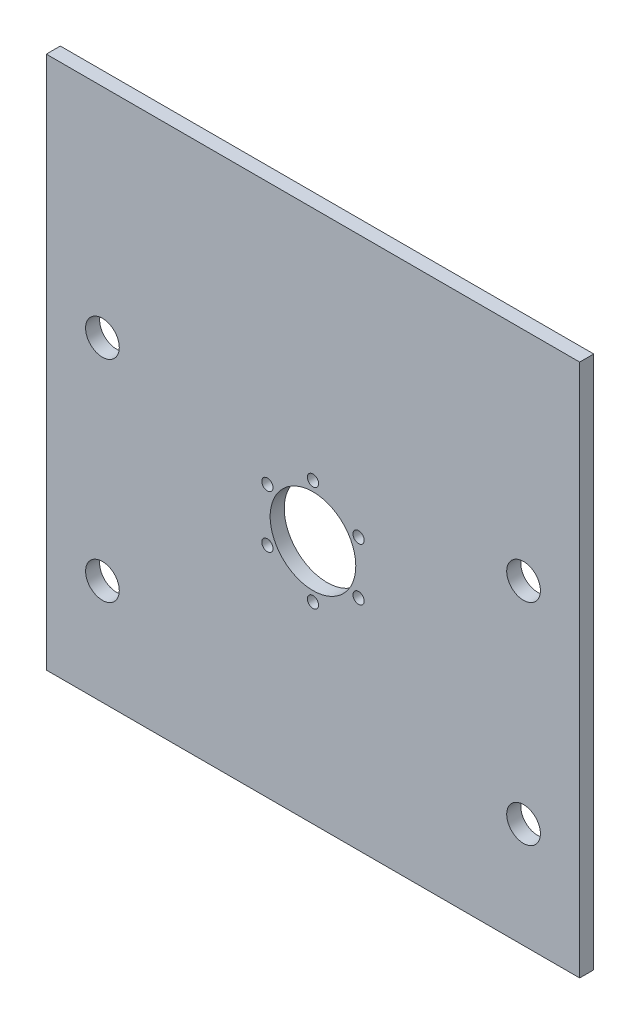
ISO-10303-21;
HEADER;
FILE_DESCRIPTION(('STEP AP214'),'2;1');
FILE_NAME('part.step','',(''),(''),'','','');
FILE_SCHEMA(('AUTOMOTIVE_DESIGN { 1 0 10303 214 1 1 1 1 }'));
ENDSEC;
DATA;
#1=APPLICATION_CONTEXT('core data for automotive mechanical design processes');
#2=APPLICATION_PROTOCOL_DEFINITION('international standard','automotive_design',2000,#1);
#3=PRODUCT_CONTEXT('',#1,'mechanical');
#4=PRODUCT('Part','Part','',(#3));
#5=PRODUCT_RELATED_PRODUCT_CATEGORY('part','',(#4));
#6=PRODUCT_DEFINITION_FORMATION('','',#4);
#7=PRODUCT_DEFINITION_CONTEXT('part definition',#1,'design');
#8=PRODUCT_DEFINITION('design','',#6,#7);
#9=PRODUCT_DEFINITION_SHAPE('','',#8);
#10=(LENGTH_UNIT() NAMED_UNIT(*) SI_UNIT(.MILLI.,.METRE.));
#11=(NAMED_UNIT(*) PLANE_ANGLE_UNIT() SI_UNIT($,.RADIAN.));
#12=(NAMED_UNIT(*) SI_UNIT($,.STERADIAN.) SOLID_ANGLE_UNIT());
#13=UNCERTAINTY_MEASURE_WITH_UNIT(LENGTH_MEASURE(1.E-05),#10,'distance_accuracy_value','');
#14=(GEOMETRIC_REPRESENTATION_CONTEXT(3) GLOBAL_UNCERTAINTY_ASSIGNED_CONTEXT((#13)) GLOBAL_UNIT_ASSIGNED_CONTEXT((#10,
#11,#12)) REPRESENTATION_CONTEXT('',''));
#15=CARTESIAN_POINT('',(0.,0.,0.));
#16=DIRECTION('',(0.,0.,1.));
#17=DIRECTION('',(1.,0.,0.));
#18=AXIS2_PLACEMENT_3D('',#15,#16,#17);
#19=CARTESIAN_POINT('',(0.,0.,5.));
#20=DIRECTION('',(0.,0.,-1.));
#21=DIRECTION('',(-1.,0.,0.));
#22=AXIS2_PLACEMENT_3D('',#19,#20,#21);
#23=PLANE('',#22);
#24=DIRECTION('',(0.,-1.,0.));
#25=VECTOR('',#24,1.);
#26=CARTESIAN_POINT('',(0.,0.,5.));
#27=LINE('',#26,#25);
#28=CARTESIAN_POINT('',(0.,190.,5.));
#29=VERTEX_POINT('',#28);
#30=CARTESIAN_POINT('',(0.,0.,5.));
#31=VERTEX_POINT('',#30);
#32=EDGE_CURVE('E69',#29,#31,#27,.T.);
#33=ORIENTED_EDGE('',*,*,#32,.T.);
#34=DIRECTION('',(1.,0.,0.));
#35=VECTOR('',#34,1.);
#36=CARTESIAN_POINT('',(0.,0.,5.));
#37=LINE('',#36,#35);
#38=CARTESIAN_POINT('',(190.,0.,5.));
#39=VERTEX_POINT('',#38);
#40=EDGE_CURVE('E64',#31,#39,#37,.T.);
#41=ORIENTED_EDGE('',*,*,#40,.T.);
#42=DIRECTION('',(0.,1.,0.));
#43=VECTOR('',#42,1.);
#44=CARTESIAN_POINT('',(190.,0.,5.));
#45=LINE('',#44,#43);
#46=CARTESIAN_POINT('',(190.,190.,5.));
#47=VERTEX_POINT('',#46);
#48=EDGE_CURVE('E67',#39,#47,#45,.T.);
#49=ORIENTED_EDGE('',*,*,#48,.T.);
#50=DIRECTION('',(-1.,0.,0.));
#51=VECTOR('',#50,1.);
#52=CARTESIAN_POINT('',(0.,190.,5.));
#53=LINE('',#52,#51);
#54=EDGE_CURVE('E34',#47,#29,#53,.T.);
#55=ORIENTED_EDGE('',*,*,#54,.T.);
#56=EDGE_LOOP('',(#33,#41,#49,#55));
#57=FACE_BOUND('',#56,.T.);
#58=CARTESIAN_POINT('',(20.,112.5,5.));
#59=DIRECTION('',(0.,0.,1.));
#60=DIRECTION('',(1.,0.,0.));
#61=AXIS2_PLACEMENT_3D('',#58,#59,#60);
#62=CIRCLE('',#61,6.);
#63=CARTESIAN_POINT('',(26.,112.5,5.));
#64=VERTEX_POINT('',#63);
#65=EDGE_CURVE('E84',#64,#64,#62,.T.);
#66=ORIENTED_EDGE('',*,*,#65,.F.);
#67=EDGE_LOOP('',(#66));
#68=FACE_BOUND('',#67,.T.);
#69=CARTESIAN_POINT('',(20.,37.5,5.));
#70=DIRECTION('',(0.,0.,1.));
#71=DIRECTION('',(1.,0.,0.));
#72=AXIS2_PLACEMENT_3D('',#69,#70,#71);
#73=CIRCLE('',#72,6.);
#74=CARTESIAN_POINT('',(26.,37.5,5.));
#75=VERTEX_POINT('',#74);
#76=EDGE_CURVE('E99',#75,#75,#73,.T.);
#77=ORIENTED_EDGE('',*,*,#76,.F.);
#78=EDGE_LOOP('',(#77));
#79=FACE_BOUND('',#78,.T.);
#80=CARTESIAN_POINT('',(170.,112.5,5.));
#81=DIRECTION('',(0.,0.,1.));
#82=DIRECTION('',(1.,0.,0.));
#83=AXIS2_PLACEMENT_3D('',#80,#81,#82);
#84=CIRCLE('',#83,6.);
#85=CARTESIAN_POINT('',(176.,112.5,5.));
#86=VERTEX_POINT('',#85);
#87=EDGE_CURVE('E105',#86,#86,#84,.T.);
#88=ORIENTED_EDGE('',*,*,#87,.F.);
#89=EDGE_LOOP('',(#88));
#90=FACE_BOUND('',#89,.T.);
#91=CARTESIAN_POINT('',(170.,37.5,5.));
#92=DIRECTION('',(0.,0.,1.));
#93=DIRECTION('',(1.,0.,0.));
#94=AXIS2_PLACEMENT_3D('',#91,#92,#93);
#95=CIRCLE('',#94,6.);
#96=CARTESIAN_POINT('',(176.,37.5,5.));
#97=VERTEX_POINT('',#96);
#98=EDGE_CURVE('E111',#97,#97,#95,.T.);
#99=ORIENTED_EDGE('',*,*,#98,.F.);
#100=EDGE_LOOP('',(#99));
#101=FACE_BOUND('',#100,.T.);
#102=CARTESIAN_POINT('',(95.,87.2453695931957,5.));
#103=DIRECTION('',(0.,0.,1.));
#104=DIRECTION('',(1.,0.,0.));
#105=AXIS2_PLACEMENT_3D('',#102,#103,#104);
#106=CIRCLE('',#105,15.25);
#107=CARTESIAN_POINT('',(110.25,87.2453695931957,5.));
#108=VERTEX_POINT('',#107);
#109=EDGE_CURVE('E117',#108,#108,#106,.T.);
#110=ORIENTED_EDGE('',*,*,#109,.F.);
#111=EDGE_LOOP('',(#110));
#112=FACE_BOUND('',#111,.T.);
#113=CARTESIAN_POINT('',(95.,105.995369593196,5.));
#114=DIRECTION('',(0.,0.,1.));
#115=DIRECTION('',(1.,0.,0.));
#116=AXIS2_PLACEMENT_3D('',#113,#114,#115);
#117=CIRCLE('',#116,2.);
#118=CARTESIAN_POINT('',(97.,105.995369593196,5.));
#119=VERTEX_POINT('',#118);
#120=EDGE_CURVE('E123',#119,#119,#117,.T.);
#121=ORIENTED_EDGE('',*,*,#120,.F.);
#122=EDGE_LOOP('',(#121));
#123=FACE_BOUND('',#122,.T.);
#124=CARTESIAN_POINT('',(111.237976320959,96.6203695931961,5.));
#125=DIRECTION('',(0.,0.,1.));
#126=DIRECTION('',(1.,0.,0.));
#127=AXIS2_PLACEMENT_3D('',#124,#125,#126);
#128=CIRCLE('',#127,1.99999999999997);
#129=CARTESIAN_POINT('',(113.237976320959,96.6203695931961,5.));
#130=VERTEX_POINT('',#129);
#131=EDGE_CURVE('E129',#130,#130,#128,.T.);
#132=ORIENTED_EDGE('',*,*,#131,.F.);
#133=EDGE_LOOP('',(#132));
#134=FACE_BOUND('',#133,.T.);
#135=CARTESIAN_POINT('',(111.237976320959,77.870369593196,5.));
#136=DIRECTION('',(0.,0.,1.));
#137=DIRECTION('',(1.,0.,0.));
#138=AXIS2_PLACEMENT_3D('',#135,#136,#137);
#139=CIRCLE('',#138,2.);
#140=CARTESIAN_POINT('',(113.237976320959,77.870369593196,5.));
#141=VERTEX_POINT('',#140);
#142=EDGE_CURVE('E135',#141,#141,#139,.T.);
#143=ORIENTED_EDGE('',*,*,#142,.F.);
#144=EDGE_LOOP('',(#143));
#145=FACE_BOUND('',#144,.T.);
#146=CARTESIAN_POINT('',(95.,68.4953695931957,5.));
#147=DIRECTION('',(0.,0.,1.));
#148=DIRECTION('',(1.,0.,0.));
#149=AXIS2_PLACEMENT_3D('',#146,#147,#148);
#150=CIRCLE('',#149,2.);
#151=CARTESIAN_POINT('',(97.,68.4953695931957,5.));
#152=VERTEX_POINT('',#151);
#153=EDGE_CURVE('E141',#152,#152,#150,.T.);
#154=ORIENTED_EDGE('',*,*,#153,.F.);
#155=EDGE_LOOP('',(#154));
#156=FACE_BOUND('',#155,.T.);
#157=CARTESIAN_POINT('',(78.7620236790425,77.8703695931954,5.));
#158=DIRECTION('',(0.,0.,1.));
#159=DIRECTION('',(1.,0.,0.));
#160=AXIS2_PLACEMENT_3D('',#157,#158,#159);
#161=CIRCLE('',#160,2.);
#162=CARTESIAN_POINT('',(80.7620236790425,77.8703695931954,5.));
#163=VERTEX_POINT('',#162);
#164=EDGE_CURVE('E147',#163,#163,#161,.T.);
#165=ORIENTED_EDGE('',*,*,#164,.F.);
#166=EDGE_LOOP('',(#165));
#167=FACE_BOUND('',#166,.T.);
#168=CARTESIAN_POINT('',(78.7620236790422,96.6203695931954,5.));
#169=DIRECTION('',(0.,0.,1.));
#170=DIRECTION('',(1.,0.,0.));
#171=AXIS2_PLACEMENT_3D('',#168,#169,#170);
#172=CIRCLE('',#171,2.);
#173=CARTESIAN_POINT('',(80.7620236790422,96.6203695931954,5.));
#174=VERTEX_POINT('',#173);
#175=EDGE_CURVE('E153',#174,#174,#172,.T.);
#176=ORIENTED_EDGE('',*,*,#175,.F.);
#177=EDGE_LOOP('',(#176));
#178=FACE_BOUND('',#177,.T.);
#179=ADVANCED_FACE('F17',(#57,#68,#79,#90,#101,#112,#123,#134,#145,#156,#167,#178),#23,.F.);
#180=CARTESIAN_POINT('',(0.,0.,0.));
#181=DIRECTION('',(0.,0.,-1.));
#182=DIRECTION('',(-1.,0.,0.));
#183=AXIS2_PLACEMENT_3D('',#180,#181,#182);
#184=PLANE('',#183);
#185=CARTESIAN_POINT('',(78.7620236790425,77.8703695931954,0.));
#186=DIRECTION('',(0.,0.,1.));
#187=DIRECTION('',(1.,0.,0.));
#188=AXIS2_PLACEMENT_3D('',#185,#186,#187);
#189=CIRCLE('',#188,2.);
#190=CARTESIAN_POINT('',(80.7620236790425,77.8703695931954,0.));
#191=VERTEX_POINT('',#190);
#192=EDGE_CURVE('E150',#191,#191,#189,.T.);
#193=ORIENTED_EDGE('',*,*,#192,.T.);
#194=EDGE_LOOP('',(#193));
#195=FACE_BOUND('',#194,.T.);
#196=CARTESIAN_POINT('',(111.237976320959,77.870369593196,0.));
#197=DIRECTION('',(0.,0.,1.));
#198=DIRECTION('',(1.,0.,0.));
#199=AXIS2_PLACEMENT_3D('',#196,#197,#198);
#200=CIRCLE('',#199,2.);
#201=CARTESIAN_POINT('',(113.237976320959,77.870369593196,0.));
#202=VERTEX_POINT('',#201);
#203=EDGE_CURVE('E138',#202,#202,#200,.T.);
#204=ORIENTED_EDGE('',*,*,#203,.T.);
#205=EDGE_LOOP('',(#204));
#206=FACE_BOUND('',#205,.T.);
#207=CARTESIAN_POINT('',(95.,105.995369593196,0.));
#208=DIRECTION('',(0.,0.,1.));
#209=DIRECTION('',(1.,0.,0.));
#210=AXIS2_PLACEMENT_3D('',#207,#208,#209);
#211=CIRCLE('',#210,2.);
#212=CARTESIAN_POINT('',(97.,105.995369593196,0.));
#213=VERTEX_POINT('',#212);
#214=EDGE_CURVE('E126',#213,#213,#211,.T.);
#215=ORIENTED_EDGE('',*,*,#214,.T.);
#216=EDGE_LOOP('',(#215));
#217=FACE_BOUND('',#216,.T.);
#218=CARTESIAN_POINT('',(170.,37.5,0.));
#219=DIRECTION('',(0.,0.,1.));
#220=DIRECTION('',(1.,0.,0.));
#221=AXIS2_PLACEMENT_3D('',#218,#219,#220);
#222=CIRCLE('',#221,6.);
#223=CARTESIAN_POINT('',(176.,37.5,0.));
#224=VERTEX_POINT('',#223);
#225=EDGE_CURVE('E114',#224,#224,#222,.T.);
#226=ORIENTED_EDGE('',*,*,#225,.T.);
#227=EDGE_LOOP('',(#226));
#228=FACE_BOUND('',#227,.T.);
#229=CARTESIAN_POINT('',(20.,37.5,0.));
#230=DIRECTION('',(0.,0.,1.));
#231=DIRECTION('',(1.,0.,0.));
#232=AXIS2_PLACEMENT_3D('',#229,#230,#231);
#233=CIRCLE('',#232,6.);
#234=CARTESIAN_POINT('',(26.,37.5,0.));
#235=VERTEX_POINT('',#234);
#236=EDGE_CURVE('E102',#235,#235,#233,.T.);
#237=ORIENTED_EDGE('',*,*,#236,.T.);
#238=EDGE_LOOP('',(#237));
#239=FACE_BOUND('',#238,.T.);
#240=DIRECTION('',(0.,-1.,0.));
#241=VECTOR('',#240,1.);
#242=CARTESIAN_POINT('',(0.,0.,0.));
#243=LINE('',#242,#241);
#244=CARTESIAN_POINT('',(0.,190.,0.));
#245=VERTEX_POINT('',#244);
#246=CARTESIAN_POINT('',(0.,0.,0.));
#247=VERTEX_POINT('',#246);
#248=EDGE_CURVE('E81',#245,#247,#243,.T.);
#249=ORIENTED_EDGE('',*,*,#248,.F.);
#250=DIRECTION('',(-1.,0.,0.));
#251=VECTOR('',#250,1.);
#252=CARTESIAN_POINT('',(0.,190.,0.));
#253=LINE('',#252,#251);
#254=CARTESIAN_POINT('',(190.,190.,0.));
#255=VERTEX_POINT('',#254);
#256=EDGE_CURVE('E57',#255,#245,#253,.T.);
#257=ORIENTED_EDGE('',*,*,#256,.F.);
#258=DIRECTION('',(0.,1.,0.));
#259=VECTOR('',#258,1.);
#260=CARTESIAN_POINT('',(190.,0.,0.));
#261=LINE('',#260,#259);
#262=CARTESIAN_POINT('',(190.,0.,0.));
#263=VERTEX_POINT('',#262);
#264=EDGE_CURVE('E51',#263,#255,#261,.T.);
#265=ORIENTED_EDGE('',*,*,#264,.F.);
#266=DIRECTION('',(1.,0.,0.));
#267=VECTOR('',#266,1.);
#268=CARTESIAN_POINT('',(0.,0.,0.));
#269=LINE('',#268,#267);
#270=EDGE_CURVE('E73',#247,#263,#269,.T.);
#271=ORIENTED_EDGE('',*,*,#270,.F.);
#272=EDGE_LOOP('',(#249,#257,#265,#271));
#273=FACE_BOUND('',#272,.T.);
#274=CARTESIAN_POINT('',(20.,112.5,0.));
#275=DIRECTION('',(0.,0.,1.));
#276=DIRECTION('',(1.,0.,0.));
#277=AXIS2_PLACEMENT_3D('',#274,#275,#276);
#278=CIRCLE('',#277,6.);
#279=CARTESIAN_POINT('',(26.,112.5,0.));
#280=VERTEX_POINT('',#279);
#281=EDGE_CURVE('E96',#280,#280,#278,.T.);
#282=ORIENTED_EDGE('',*,*,#281,.T.);
#283=EDGE_LOOP('',(#282));
#284=FACE_BOUND('',#283,.T.);
#285=CARTESIAN_POINT('',(170.,112.5,0.));
#286=DIRECTION('',(0.,0.,1.));
#287=DIRECTION('',(1.,0.,0.));
#288=AXIS2_PLACEMENT_3D('',#285,#286,#287);
#289=CIRCLE('',#288,6.);
#290=CARTESIAN_POINT('',(176.,112.5,0.));
#291=VERTEX_POINT('',#290);
#292=EDGE_CURVE('E108',#291,#291,#289,.T.);
#293=ORIENTED_EDGE('',*,*,#292,.T.);
#294=EDGE_LOOP('',(#293));
#295=FACE_BOUND('',#294,.T.);
#296=CARTESIAN_POINT('',(95.,87.2453695931957,0.));
#297=DIRECTION('',(0.,0.,1.));
#298=DIRECTION('',(1.,0.,0.));
#299=AXIS2_PLACEMENT_3D('',#296,#297,#298);
#300=CIRCLE('',#299,15.25);
#301=CARTESIAN_POINT('',(110.25,87.2453695931957,0.));
#302=VERTEX_POINT('',#301);
#303=EDGE_CURVE('E120',#302,#302,#300,.T.);
#304=ORIENTED_EDGE('',*,*,#303,.T.);
#305=EDGE_LOOP('',(#304));
#306=FACE_BOUND('',#305,.T.);
#307=CARTESIAN_POINT('',(111.237976320959,96.6203695931961,0.));
#308=DIRECTION('',(0.,0.,1.));
#309=DIRECTION('',(1.,0.,0.));
#310=AXIS2_PLACEMENT_3D('',#307,#308,#309);
#311=CIRCLE('',#310,1.99999999999997);
#312=CARTESIAN_POINT('',(113.237976320959,96.6203695931961,0.));
#313=VERTEX_POINT('',#312);
#314=EDGE_CURVE('E132',#313,#313,#311,.T.);
#315=ORIENTED_EDGE('',*,*,#314,.T.);
#316=EDGE_LOOP('',(#315));
#317=FACE_BOUND('',#316,.T.);
#318=CARTESIAN_POINT('',(95.,68.4953695931957,0.));
#319=DIRECTION('',(0.,0.,1.));
#320=DIRECTION('',(1.,0.,0.));
#321=AXIS2_PLACEMENT_3D('',#318,#319,#320);
#322=CIRCLE('',#321,2.);
#323=CARTESIAN_POINT('',(97.,68.4953695931957,0.));
#324=VERTEX_POINT('',#323);
#325=EDGE_CURVE('E144',#324,#324,#322,.T.);
#326=ORIENTED_EDGE('',*,*,#325,.T.);
#327=EDGE_LOOP('',(#326));
#328=FACE_BOUND('',#327,.T.);
#329=CARTESIAN_POINT('',(78.7620236790422,96.6203695931954,0.));
#330=DIRECTION('',(0.,0.,1.));
#331=DIRECTION('',(1.,0.,0.));
#332=AXIS2_PLACEMENT_3D('',#329,#330,#331);
#333=CIRCLE('',#332,2.);
#334=CARTESIAN_POINT('',(80.7620236790422,96.6203695931954,0.));
#335=VERTEX_POINT('',#334);
#336=EDGE_CURVE('E156',#335,#335,#333,.T.);
#337=ORIENTED_EDGE('',*,*,#336,.T.);
#338=EDGE_LOOP('',(#337));
#339=FACE_BOUND('',#338,.T.);
#340=ADVANCED_FACE('F92',(#195,#206,#217,#228,#239,#273,#284,#295,#306,#317,#328,#339),#184,.T.);
#341=CARTESIAN_POINT('',(0.,0.,5.));
#342=DIRECTION('',(1.,0.,0.));
#343=DIRECTION('',(0.,0.,-1.));
#344=AXIS2_PLACEMENT_3D('',#341,#342,#343);
#345=PLANE('',#344);
#346=ORIENTED_EDGE('',*,*,#248,.T.);
#347=DIRECTION('',(0.,0.,-1.));
#348=VECTOR('',#347,1.);
#349=CARTESIAN_POINT('',(0.,0.,5.));
#350=LINE('',#349,#348);
#351=EDGE_CURVE('E11',#31,#247,#350,.T.);
#352=ORIENTED_EDGE('',*,*,#351,.F.);
#353=ORIENTED_EDGE('',*,*,#32,.F.);
#354=DIRECTION('',(0.,0.,-1.));
#355=VECTOR('',#354,1.);
#356=CARTESIAN_POINT('',(0.,190.,5.));
#357=LINE('',#356,#355);
#358=EDGE_CURVE('E77',#29,#245,#357,.T.);
#359=ORIENTED_EDGE('',*,*,#358,.T.);
#360=EDGE_LOOP('',(#346,#352,#353,#359));
#361=FACE_BOUND('',#360,.T.);
#362=ADVANCED_FACE('F19',(#361),#345,.F.);
#363=CARTESIAN_POINT('',(0.,0.,5.));
#364=DIRECTION('',(0.,1.,0.));
#365=DIRECTION('',(0.,0.,1.));
#366=AXIS2_PLACEMENT_3D('',#363,#364,#365);
#367=PLANE('',#366);
#368=ORIENTED_EDGE('',*,*,#270,.T.);
#369=DIRECTION('',(0.,0.,-1.));
#370=VECTOR('',#369,1.);
#371=CARTESIAN_POINT('',(190.,0.,5.));
#372=LINE('',#371,#370);
#373=EDGE_CURVE('E26',#39,#263,#372,.T.);
#374=ORIENTED_EDGE('',*,*,#373,.F.);
#375=ORIENTED_EDGE('',*,*,#40,.F.);
#376=ORIENTED_EDGE('',*,*,#351,.T.);
#377=EDGE_LOOP('',(#368,#374,#375,#376));
#378=FACE_BOUND('',#377,.T.);
#379=ADVANCED_FACE('F72',(#378),#367,.F.);
#380=CARTESIAN_POINT('',(190.,0.,5.));
#381=DIRECTION('',(-1.,0.,0.));
#382=DIRECTION('',(0.,0.,1.));
#383=AXIS2_PLACEMENT_3D('',#380,#381,#382);
#384=PLANE('',#383);
#385=ORIENTED_EDGE('',*,*,#264,.T.);
#386=DIRECTION('',(0.,0.,-1.));
#387=VECTOR('',#386,1.);
#388=CARTESIAN_POINT('',(190.,190.,5.));
#389=LINE('',#388,#387);
#390=EDGE_CURVE('E74',#47,#255,#389,.T.);
#391=ORIENTED_EDGE('',*,*,#390,.F.);
#392=ORIENTED_EDGE('',*,*,#48,.F.);
#393=ORIENTED_EDGE('',*,*,#373,.T.);
#394=EDGE_LOOP('',(#385,#391,#392,#393));
#395=FACE_BOUND('',#394,.T.);
#396=ADVANCED_FACE('F75',(#395),#384,.F.);
#397=CARTESIAN_POINT('',(0.,190.,5.));
#398=DIRECTION('',(0.,-1.,0.));
#399=DIRECTION('',(0.,0.,-1.));
#400=AXIS2_PLACEMENT_3D('',#397,#398,#399);
#401=PLANE('',#400);
#402=ORIENTED_EDGE('',*,*,#256,.T.);
#403=ORIENTED_EDGE('',*,*,#358,.F.);
#404=ORIENTED_EDGE('',*,*,#54,.F.);
#405=ORIENTED_EDGE('',*,*,#390,.T.);
#406=EDGE_LOOP('',(#402,#403,#404,#405));
#407=FACE_BOUND('',#406,.T.);
#408=ADVANCED_FACE('F89',(#407),#401,.F.);
#409=CARTESIAN_POINT('',(20.,112.5,5.));
#410=DIRECTION('',(0.,0.,-1.));
#411=DIRECTION('',(-1.,0.,0.));
#412=AXIS2_PLACEMENT_3D('',#409,#410,#411);
#413=CYLINDRICAL_SURFACE('',#412,6.);
#414=ORIENTED_EDGE('',*,*,#65,.T.);
#415=EDGE_LOOP('',(#414));
#416=FACE_BOUND('',#415,.T.);
#417=ORIENTED_EDGE('',*,*,#281,.F.);
#418=EDGE_LOOP('',(#417));
#419=FACE_BOUND('',#418,.T.);
#420=ADVANCED_FACE('F175',(#416,#419),#413,.F.);
#421=CARTESIAN_POINT('',(20.,37.5,5.));
#422=DIRECTION('',(0.,0.,-1.));
#423=DIRECTION('',(-1.,0.,0.));
#424=AXIS2_PLACEMENT_3D('',#421,#422,#423);
#425=CYLINDRICAL_SURFACE('',#424,6.);
#426=ORIENTED_EDGE('',*,*,#76,.T.);
#427=EDGE_LOOP('',(#426));
#428=FACE_BOUND('',#427,.T.);
#429=ORIENTED_EDGE('',*,*,#236,.F.);
#430=EDGE_LOOP('',(#429));
#431=FACE_BOUND('',#430,.T.);
#432=ADVANCED_FACE('F228',(#428,#431),#425,.F.);
#433=CARTESIAN_POINT('',(170.,112.5,5.));
#434=DIRECTION('',(0.,0.,-1.));
#435=DIRECTION('',(-1.,0.,0.));
#436=AXIS2_PLACEMENT_3D('',#433,#434,#435);
#437=CYLINDRICAL_SURFACE('',#436,6.);
#438=ORIENTED_EDGE('',*,*,#87,.T.);
#439=EDGE_LOOP('',(#438));
#440=FACE_BOUND('',#439,.T.);
#441=ORIENTED_EDGE('',*,*,#292,.F.);
#442=EDGE_LOOP('',(#441));
#443=FACE_BOUND('',#442,.T.);
#444=ADVANCED_FACE('F235',(#440,#443),#437,.F.);
#445=CARTESIAN_POINT('',(170.,37.5,5.));
#446=DIRECTION('',(0.,0.,-1.));
#447=DIRECTION('',(-1.,0.,0.));
#448=AXIS2_PLACEMENT_3D('',#445,#446,#447);
#449=CYLINDRICAL_SURFACE('',#448,6.);
#450=ORIENTED_EDGE('',*,*,#98,.T.);
#451=EDGE_LOOP('',(#450));
#452=FACE_BOUND('',#451,.T.);
#453=ORIENTED_EDGE('',*,*,#225,.F.);
#454=EDGE_LOOP('',(#453));
#455=FACE_BOUND('',#454,.T.);
#456=ADVANCED_FACE('F243',(#452,#455),#449,.F.);
#457=CARTESIAN_POINT('',(95.,87.2453695931957,5.));
#458=DIRECTION('',(0.,0.,-1.));
#459=DIRECTION('',(-1.,0.,0.));
#460=AXIS2_PLACEMENT_3D('',#457,#458,#459);
#461=CYLINDRICAL_SURFACE('',#460,15.25);
#462=ORIENTED_EDGE('',*,*,#109,.T.);
#463=EDGE_LOOP('',(#462));
#464=FACE_BOUND('',#463,.T.);
#465=ORIENTED_EDGE('',*,*,#303,.F.);
#466=EDGE_LOOP('',(#465));
#467=FACE_BOUND('',#466,.T.);
#468=ADVANCED_FACE('F252',(#464,#467),#461,.F.);
#469=CARTESIAN_POINT('',(95.,105.995369593196,5.));
#470=DIRECTION('',(0.,0.,-1.));
#471=DIRECTION('',(-1.,0.,0.));
#472=AXIS2_PLACEMENT_3D('',#469,#470,#471);
#473=CYLINDRICAL_SURFACE('',#472,2.);
#474=ORIENTED_EDGE('',*,*,#120,.T.);
#475=EDGE_LOOP('',(#474));
#476=FACE_BOUND('',#475,.T.);
#477=ORIENTED_EDGE('',*,*,#214,.F.);
#478=EDGE_LOOP('',(#477));
#479=FACE_BOUND('',#478,.T.);
#480=ADVANCED_FACE('F261',(#476,#479),#473,.F.);
#481=CARTESIAN_POINT('',(111.237976320959,96.6203695931961,5.));
#482=DIRECTION('',(0.,0.,-1.));
#483=DIRECTION('',(-1.,0.,0.));
#484=AXIS2_PLACEMENT_3D('',#481,#482,#483);
#485=CYLINDRICAL_SURFACE('',#484,1.99999999999997);
#486=ORIENTED_EDGE('',*,*,#131,.T.);
#487=EDGE_LOOP('',(#486));
#488=FACE_BOUND('',#487,.T.);
#489=ORIENTED_EDGE('',*,*,#314,.F.);
#490=EDGE_LOOP('',(#489));
#491=FACE_BOUND('',#490,.T.);
#492=ADVANCED_FACE('F270',(#488,#491),#485,.F.);
#493=CARTESIAN_POINT('',(111.237976320959,77.870369593196,5.));
#494=DIRECTION('',(0.,0.,-1.));
#495=DIRECTION('',(-1.,0.,0.));
#496=AXIS2_PLACEMENT_3D('',#493,#494,#495);
#497=CYLINDRICAL_SURFACE('',#496,2.);
#498=ORIENTED_EDGE('',*,*,#142,.T.);
#499=EDGE_LOOP('',(#498));
#500=FACE_BOUND('',#499,.T.);
#501=ORIENTED_EDGE('',*,*,#203,.F.);
#502=EDGE_LOOP('',(#501));
#503=FACE_BOUND('',#502,.T.);
#504=ADVANCED_FACE('F279',(#500,#503),#497,.F.);
#505=CARTESIAN_POINT('',(95.,68.4953695931957,5.));
#506=DIRECTION('',(0.,0.,-1.));
#507=DIRECTION('',(-1.,0.,0.));
#508=AXIS2_PLACEMENT_3D('',#505,#506,#507);
#509=CYLINDRICAL_SURFACE('',#508,2.);
#510=ORIENTED_EDGE('',*,*,#153,.T.);
#511=EDGE_LOOP('',(#510));
#512=FACE_BOUND('',#511,.T.);
#513=ORIENTED_EDGE('',*,*,#325,.F.);
#514=EDGE_LOOP('',(#513));
#515=FACE_BOUND('',#514,.T.);
#516=ADVANCED_FACE('F288',(#512,#515),#509,.F.);
#517=CARTESIAN_POINT('',(78.7620236790425,77.8703695931954,5.));
#518=DIRECTION('',(0.,0.,-1.));
#519=DIRECTION('',(-1.,0.,0.));
#520=AXIS2_PLACEMENT_3D('',#517,#518,#519);
#521=CYLINDRICAL_SURFACE('',#520,2.);
#522=ORIENTED_EDGE('',*,*,#164,.T.);
#523=EDGE_LOOP('',(#522));
#524=FACE_BOUND('',#523,.T.);
#525=ORIENTED_EDGE('',*,*,#192,.F.);
#526=EDGE_LOOP('',(#525));
#527=FACE_BOUND('',#526,.T.);
#528=ADVANCED_FACE('F297',(#524,#527),#521,.F.);
#529=CARTESIAN_POINT('',(78.7620236790422,96.6203695931954,5.));
#530=DIRECTION('',(0.,0.,-1.));
#531=DIRECTION('',(-1.,0.,0.));
#532=AXIS2_PLACEMENT_3D('',#529,#530,#531);
#533=CYLINDRICAL_SURFACE('',#532,2.);
#534=ORIENTED_EDGE('',*,*,#175,.T.);
#535=EDGE_LOOP('',(#534));
#536=FACE_BOUND('',#535,.T.);
#537=ORIENTED_EDGE('',*,*,#336,.F.);
#538=EDGE_LOOP('',(#537));
#539=FACE_BOUND('',#538,.T.);
#540=ADVANCED_FACE('F162',(#536,#539),#533,.F.);
#541=CLOSED_SHELL('',(#179,#340,#362,#379,#396,#408,#420,#432,#444,#456,#468,#480,#492,#504,
#516,#528,#540));
#542=MANIFOLD_SOLID_BREP('B1',#541);
#543=ADVANCED_BREP_SHAPE_REPRESENTATION('',(#18,#542),#14);
#544=SHAPE_DEFINITION_REPRESENTATION(#9,#543);
ENDSEC;
END-ISO-10303-21;
